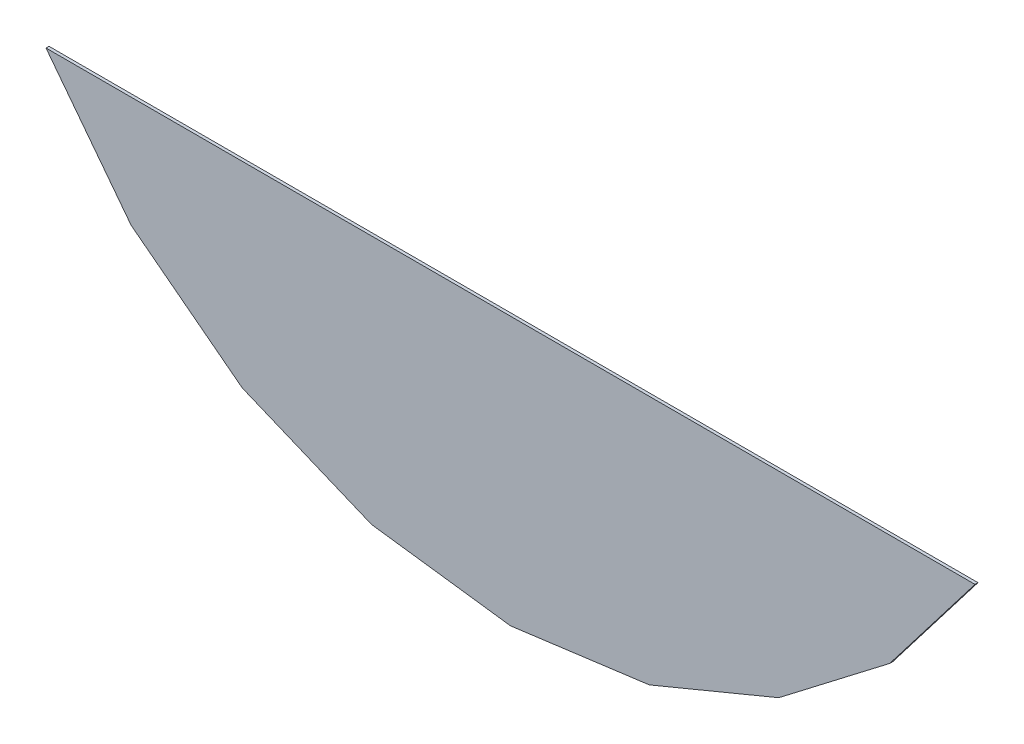
ISO-10303-21;
HEADER;
FILE_DESCRIPTION(('STEP AP214'),'2;1');
FILE_NAME('part.step','',(''),(''),'','','');
FILE_SCHEMA(('AUTOMOTIVE_DESIGN { 1 0 10303 214 1 1 1 1 }'));
ENDSEC;
DATA;
#1=APPLICATION_CONTEXT('core data for automotive mechanical design processes');
#2=APPLICATION_PROTOCOL_DEFINITION('international standard','automotive_design',2000,#1);
#3=PRODUCT_CONTEXT('',#1,'mechanical');
#4=PRODUCT('Part','Part','',(#3));
#5=PRODUCT_RELATED_PRODUCT_CATEGORY('part','',(#4));
#6=PRODUCT_DEFINITION_FORMATION('','',#4);
#7=PRODUCT_DEFINITION_CONTEXT('part definition',#1,'design');
#8=PRODUCT_DEFINITION('design','',#6,#7);
#9=PRODUCT_DEFINITION_SHAPE('','',#8);
#10=(LENGTH_UNIT() NAMED_UNIT(*) SI_UNIT(.MILLI.,.METRE.));
#11=(NAMED_UNIT(*) PLANE_ANGLE_UNIT() SI_UNIT($,.RADIAN.));
#12=(NAMED_UNIT(*) SI_UNIT($,.STERADIAN.) SOLID_ANGLE_UNIT());
#13=UNCERTAINTY_MEASURE_WITH_UNIT(LENGTH_MEASURE(1.E-05),#10,'distance_accuracy_value','');
#14=(GEOMETRIC_REPRESENTATION_CONTEXT(3) GLOBAL_UNCERTAINTY_ASSIGNED_CONTEXT((#13)) GLOBAL_UNIT_ASSIGNED_CONTEXT((#10,
#11,#12)) REPRESENTATION_CONTEXT('',''));
#15=CARTESIAN_POINT('',(0.,0.,0.));
#16=DIRECTION('',(0.,0.,1.));
#17=DIRECTION('',(1.,0.,0.));
#18=AXIS2_PLACEMENT_3D('',#15,#16,#17);
#19=CARTESIAN_POINT('',(-1.5588488,-2.74280376,3.9099998));
#20=DIRECTION('',(0.,0.,1.));
#21=DIRECTION('',(1.,0.,0.));
#22=AXIS2_PLACEMENT_3D('',#19,#20,#21);
#23=PLANE('',#22);
#24=DIRECTION('',(0.923880918501279,0.382680086272116,0.));
#25=VECTOR('',#24,1.);
#26=CARTESIAN_POINT('',(0.465871559999998,-3.58146857999999,3.9099998));
#27=LINE('',#26,#25);
#28=CARTESIAN_POINT('',(0.465871559999994,-3.58146857999999,3.9099998));
#29=VERTEX_POINT('',#28);
#30=CARTESIAN_POINT('',(0.899998200000018,-3.40164928000003,3.9099998));
#31=VERTEX_POINT('',#30);
#32=EDGE_CURVE('E91',#29,#31,#27,.T.);
#33=ORIENTED_EDGE('',*,*,#32,.T.);
#34=DIRECTION('',(0.79335085331093,0.608764670090848,0.));
#35=VECTOR('',#34,1.);
#36=CARTESIAN_POINT('',(0.899998200000011,-3.40164928000002,3.9099998));
#37=LINE('',#36,#35);
#38=CARTESIAN_POINT('',(1.27278891999997,-3.11559447999999,3.9099998));
#39=VERTEX_POINT('',#38);
#40=EDGE_CURVE('E88',#31,#39,#37,.T.);
#41=ORIENTED_EDGE('',*,*,#40,.T.);
#42=DIRECTION('',(0.608764670090813,0.793350853310957,0.));
#43=VECTOR('',#42,1.);
#44=CARTESIAN_POINT('',(1.27278891999998,-3.11559447999999,3.9099998));
#45=LINE('',#44,#43);
#46=CARTESIAN_POINT('',(1.55884372,-2.74280376,3.9099998));
#47=VERTEX_POINT('',#46);
#48=EDGE_CURVE('E20',#39,#47,#45,.T.);
#49=ORIENTED_EDGE('',*,*,#48,.T.);
#50=DIRECTION('',(1.,0.,0.));
#51=VECTOR('',#50,1.);
#52=CARTESIAN_POINT('',(-1.5588488,-2.74280376,3.9099998));
#53=LINE('',#52,#51);
#54=CARTESIAN_POINT('',(-1.55884880000005,-2.74280376000001,3.9099998));
#55=VERTEX_POINT('',#54);
#56=EDGE_CURVE('E94',#55,#47,#53,.T.);
#57=ORIENTED_EDGE('',*,*,#56,.F.);
#58=DIRECTION('',(0.608764670090872,-0.793350853310912,0.));
#59=VECTOR('',#58,1.);
#60=CARTESIAN_POINT('',(-1.55884880000003,-2.74280376000002,3.9099998));
#61=LINE('',#60,#59);
#62=CARTESIAN_POINT('',(-1.27279399999999,-3.11559447999997,3.9099998));
#63=VERTEX_POINT('',#62);
#64=EDGE_CURVE('E84',#55,#63,#61,.T.);
#65=ORIENTED_EDGE('',*,*,#64,.T.);
#66=DIRECTION('',(0.793350853310943,-0.608764670090831,0.));
#67=VECTOR('',#66,1.);
#68=CARTESIAN_POINT('',(-1.27279399999999,-3.11559447999998,3.9099998));
#69=LINE('',#68,#67);
#70=CARTESIAN_POINT('',(-0.900003280000005,-3.40164928000001,3.9099998));
#71=VERTEX_POINT('',#70);
#72=EDGE_CURVE('E105',#63,#71,#69,.T.);
#73=ORIENTED_EDGE('',*,*,#72,.T.);
#74=DIRECTION('',(0.923880918501228,-0.382680086272237,0.));
#75=VECTOR('',#74,1.);
#76=CARTESIAN_POINT('',(-0.900003280000004,-3.40164928000001,3.9099998));
#77=LINE('',#76,#75);
#78=CARTESIAN_POINT('',(-0.465876640000007,-3.58146858000006,3.9099998));
#79=VERTEX_POINT('',#78);
#80=EDGE_CURVE('E106',#71,#79,#77,.T.);
#81=ORIENTED_EDGE('',*,*,#80,.T.);
#82=DIRECTION('',(0.991444891344724,-0.130525964568163,0.));
#83=VECTOR('',#82,1.);
#84=CARTESIAN_POINT('',(-0.465876640000006,-3.58146858000004,3.9099998));
#85=LINE('',#84,#83);
#86=CARTESIAN_POINT('',(-2.54000000878586E-06,-3.64280195999994,3.9099998));
#87=VERTEX_POINT('',#86);
#88=EDGE_CURVE('E110',#79,#87,#85,.T.);
#89=ORIENTED_EDGE('',*,*,#88,.T.);
#90=DIRECTION('',(0.99144489134471,0.130525964568269,0.));
#91=VECTOR('',#90,1.);
#92=CARTESIAN_POINT('',(-2.54000000307793E-06,-3.64280195999996,3.9099998));
#93=LINE('',#92,#91);
#94=EDGE_CURVE('E112',#87,#29,#93,.T.);
#95=ORIENTED_EDGE('',*,*,#94,.T.);
#96=EDGE_LOOP('',(#33,#41,#49,#57,#65,#73,#81,#89,#95));
#97=FACE_BOUND('',#96,.T.);
#98=ADVANCED_FACE('F17',(#97),#23,.T.);
#99=CARTESIAN_POINT('',(-1.5588488,-2.74280376,3.89999982));
#100=DIRECTION('',(0.,1.,0.));
#101=DIRECTION('',(0.,0.,1.));
#102=AXIS2_PLACEMENT_3D('',#99,#100,#101);
#103=PLANE('',#102);
#104=DIRECTION('',(0.,0.,1.));
#105=VECTOR('',#104,1.);
#106=CARTESIAN_POINT('',(-1.55884880000006,-2.74280376000005,3.89999982));
#107=LINE('',#106,#105);
#108=CARTESIAN_POINT('',(-1.55884880000004,-2.74280376000001,3.89999982));
#109=VERTEX_POINT('',#108);
#110=EDGE_CURVE('E116',#55,#109,#107,.F.);
#111=ORIENTED_EDGE('',*,*,#110,.F.);
#112=ORIENTED_EDGE('',*,*,#56,.T.);
#113=DIRECTION('',(0.,0.,1.));
#114=VECTOR('',#113,1.);
#115=CARTESIAN_POINT('',(1.55884372,-2.74280376,3.89999982));
#116=LINE('',#115,#114);
#117=CARTESIAN_POINT('',(1.55884372,-2.74280376,3.89999982));
#118=VERTEX_POINT('',#117);
#119=EDGE_CURVE('E99',#118,#47,#116,.T.);
#120=ORIENTED_EDGE('',*,*,#119,.F.);
#121=DIRECTION('',(1.,0.,0.));
#122=VECTOR('',#121,1.);
#123=CARTESIAN_POINT('',(-1.5588488,-2.74280376,3.89999982));
#124=LINE('',#123,#122);
#125=EDGE_CURVE('E130',#118,#109,#124,.F.);
#126=ORIENTED_EDGE('',*,*,#125,.T.);
#127=EDGE_LOOP('',(#111,#112,#120,#126));
#128=FACE_BOUND('',#127,.T.);
#129=ADVANCED_FACE('F181',(#128),#103,.T.);
#130=CARTESIAN_POINT('',(-1.272794,-3.11559448,3.89999982));
#131=DIRECTION('',(-0.793350853310883,-0.60876467009091,0.));
#132=DIRECTION('',(0.60876467009091,-0.793350853310883,0.));
#133=AXIS2_PLACEMENT_3D('',#130,#131,#132);
#134=PLANE('',#133);
#135=DIRECTION('',(0.,0.,1.));
#136=VECTOR('',#135,1.);
#137=CARTESIAN_POINT('',(-1.27279399999996,-3.11559447999994,3.89999982));
#138=LINE('',#137,#136);
#139=CARTESIAN_POINT('',(-1.27279399999999,-3.11559447999997,3.89999982));
#140=VERTEX_POINT('',#139);
#141=EDGE_CURVE('E118',#63,#140,#138,.F.);
#142=ORIENTED_EDGE('',*,*,#141,.F.);
#143=ORIENTED_EDGE('',*,*,#64,.F.);
#144=ORIENTED_EDGE('',*,*,#110,.T.);
#145=DIRECTION('',(0.608764670090872,-0.793350853310912,0.));
#146=VECTOR('',#145,1.);
#147=CARTESIAN_POINT('',(-1.55884880000003,-2.74280376000002,3.89999982));
#148=LINE('',#147,#146);
#149=EDGE_CURVE('E133',#109,#140,#148,.T.);
#150=ORIENTED_EDGE('',*,*,#149,.T.);
#151=EDGE_LOOP('',(#142,#143,#144,#150));
#152=FACE_BOUND('',#151,.T.);
#153=ADVANCED_FACE('F178',(#152),#134,.T.);
#154=CARTESIAN_POINT('',(-0.90000328,-3.40164928,3.89999982));
#155=DIRECTION('',(-0.60876467009091,-0.793350853310883,0.));
#156=DIRECTION('',(0.793350853310883,-0.60876467009091,0.));
#157=AXIS2_PLACEMENT_3D('',#154,#155,#156);
#158=PLANE('',#157);
#159=DIRECTION('',(0.,0.,1.));
#160=VECTOR('',#159,1.);
#161=CARTESIAN_POINT('',(-0.900003280000013,-3.40164928000003,3.89999982));
#162=LINE('',#161,#160);
#163=CARTESIAN_POINT('',(-0.900003280000003,-3.40164928000001,3.89999982));
#164=VERTEX_POINT('',#163);
#165=EDGE_CURVE('E120',#71,#164,#162,.F.);
#166=ORIENTED_EDGE('',*,*,#165,.F.);
#167=ORIENTED_EDGE('',*,*,#72,.F.);
#168=ORIENTED_EDGE('',*,*,#141,.T.);
#169=DIRECTION('',(0.793350853310943,-0.608764670090831,0.));
#170=VECTOR('',#169,1.);
#171=CARTESIAN_POINT('',(-1.27279399999999,-3.11559447999998,3.89999982));
#172=LINE('',#171,#170);
#173=EDGE_CURVE('E136',#140,#164,#172,.T.);
#174=ORIENTED_EDGE('',*,*,#173,.T.);
#175=EDGE_LOOP('',(#166,#167,#168,#174));
#176=FACE_BOUND('',#175,.T.);
#177=ADVANCED_FACE('F175',(#176),#158,.T.);
#178=CARTESIAN_POINT('',(-0.46587664,-3.58146858,3.89999982));
#179=DIRECTION('',(-0.382680086272115,-0.923880918501279,0.));
#180=DIRECTION('',(0.923880918501279,-0.382680086272115,0.));
#181=AXIS2_PLACEMENT_3D('',#178,#179,#180);
#182=PLANE('',#181);
#183=DIRECTION('',(0.,0.,1.));
#184=VECTOR('',#183,1.);
#185=CARTESIAN_POINT('',(-0.465876640000023,-3.58146858000017,3.89999982));
#186=LINE('',#185,#184);
#187=CARTESIAN_POINT('',(-0.465876640000003,-3.58146858000005,3.89999982));
#188=VERTEX_POINT('',#187);
#189=EDGE_CURVE('E122',#79,#188,#186,.F.);
#190=ORIENTED_EDGE('',*,*,#189,.F.);
#191=ORIENTED_EDGE('',*,*,#80,.F.);
#192=ORIENTED_EDGE('',*,*,#165,.T.);
#193=DIRECTION('',(0.923880918501228,-0.382680086272237,0.));
#194=VECTOR('',#193,1.);
#195=CARTESIAN_POINT('',(-0.900003280000004,-3.40164928000001,3.89999982));
#196=LINE('',#195,#194);
#197=EDGE_CURVE('E139',#164,#188,#196,.T.);
#198=ORIENTED_EDGE('',*,*,#197,.T.);
#199=EDGE_LOOP('',(#190,#191,#192,#198));
#200=FACE_BOUND('',#199,.T.);
#201=ADVANCED_FACE('F170',(#200),#182,.T.);
#202=CARTESIAN_POINT('',(-2.539999996998E-06,-3.64280196,3.89999982));
#203=DIRECTION('',(-0.130525964567967,-0.991444891344749,0.));
#204=DIRECTION('',(0.991444891344749,-0.130525964567967,0.));
#205=AXIS2_PLACEMENT_3D('',#202,#203,#204);
#206=PLANE('',#205);
#207=DIRECTION('',(0.,0.,1.));
#208=VECTOR('',#207,1.);
#209=CARTESIAN_POINT('',(-2.54000002047937E-06,-3.64280195999983,3.89999982));
#210=LINE('',#209,#208);
#211=CARTESIAN_POINT('',(-2.54000000975995E-06,-3.64280195999995,3.89999982));
#212=VERTEX_POINT('',#211);
#213=EDGE_CURVE('E124',#87,#212,#210,.F.);
#214=ORIENTED_EDGE('',*,*,#213,.F.);
#215=ORIENTED_EDGE('',*,*,#88,.F.);
#216=ORIENTED_EDGE('',*,*,#189,.T.);
#217=DIRECTION('',(0.991444891344724,-0.130525964568163,0.));
#218=VECTOR('',#217,1.);
#219=CARTESIAN_POINT('',(-0.465876640000006,-3.58146858000004,3.89999982));
#220=LINE('',#219,#218);
#221=EDGE_CURVE('E142',#188,#212,#220,.T.);
#222=ORIENTED_EDGE('',*,*,#221,.T.);
#223=EDGE_LOOP('',(#214,#215,#216,#222));
#224=FACE_BOUND('',#223,.T.);
#225=ADVANCED_FACE('F165',(#224),#206,.T.);
#226=CARTESIAN_POINT('',(0.46587156,-3.58146858,3.89999982));
#227=DIRECTION('',(0.130525964567967,-0.991444891344749,0.));
#228=DIRECTION('',(0.991444891344749,0.130525964567967,0.));
#229=AXIS2_PLACEMENT_3D('',#226,#227,#228);
#230=PLANE('',#229);
#231=DIRECTION('',(0.,0.,1.));
#232=VECTOR('',#231,1.);
#233=CARTESIAN_POINT('',(0.465871559999989,-3.58146857999997,3.89999982));
#234=LINE('',#233,#232);
#235=CARTESIAN_POINT('',(0.465871559999995,-3.58146857999999,3.89999982));
#236=VERTEX_POINT('',#235);
#237=EDGE_CURVE('E126',#29,#236,#234,.F.);
#238=ORIENTED_EDGE('',*,*,#237,.F.);
#239=ORIENTED_EDGE('',*,*,#94,.F.);
#240=ORIENTED_EDGE('',*,*,#213,.T.);
#241=DIRECTION('',(0.99144489134471,0.130525964568269,0.));
#242=VECTOR('',#241,1.);
#243=CARTESIAN_POINT('',(-2.54000000286109E-06,-3.64280195999996,3.89999982));
#244=LINE('',#243,#242);
#245=EDGE_CURVE('E145',#212,#236,#244,.T.);
#246=ORIENTED_EDGE('',*,*,#245,.T.);
#247=EDGE_LOOP('',(#238,#239,#240,#246));
#248=FACE_BOUND('',#247,.T.);
#249=ADVANCED_FACE('F160',(#248),#230,.T.);
#250=CARTESIAN_POINT('',(0.8999982,-3.40164928,3.89999982));
#251=DIRECTION('',(0.382680086272115,-0.923880918501279,0.));
#252=DIRECTION('',(0.923880918501279,0.382680086272115,0.));
#253=AXIS2_PLACEMENT_3D('',#250,#251,#252);
#254=PLANE('',#253);
#255=DIRECTION('',(0.,0.,1.));
#256=VECTOR('',#255,1.);
#257=CARTESIAN_POINT('',(0.899998200000045,-3.40164928000006,3.89999982));
#258=LINE('',#257,#256);
#259=CARTESIAN_POINT('',(0.899998200000015,-3.40164928000002,3.89999982));
#260=VERTEX_POINT('',#259);
#261=EDGE_CURVE('E100',#31,#260,#258,.F.);
#262=ORIENTED_EDGE('',*,*,#261,.F.);
#263=ORIENTED_EDGE('',*,*,#32,.F.);
#264=ORIENTED_EDGE('',*,*,#237,.T.);
#265=DIRECTION('',(0.923880918501279,0.382680086272115,0.));
#266=VECTOR('',#265,1.);
#267=CARTESIAN_POINT('',(0.465871559999997,-3.58146857999999,3.89999982));
#268=LINE('',#267,#266);
#269=EDGE_CURVE('E148',#236,#260,#268,.T.);
#270=ORIENTED_EDGE('',*,*,#269,.T.);
#271=EDGE_LOOP('',(#262,#263,#264,#270));
#272=FACE_BOUND('',#271,.T.);
#273=ADVANCED_FACE('F153',(#272),#254,.T.);
#274=CARTESIAN_POINT('',(1.27278892,-3.11559448,3.89999982));
#275=DIRECTION('',(0.60876467009091,-0.793350853310883,0.));
#276=DIRECTION('',(0.793350853310883,0.60876467009091,0.));
#277=AXIS2_PLACEMENT_3D('',#274,#275,#276);
#278=PLANE('',#277);
#279=DIRECTION('',(0.,0.,1.));
#280=VECTOR('',#279,1.);
#281=CARTESIAN_POINT('',(1.27278891999993,-3.11559447999996,3.89999982));
#282=LINE('',#281,#280);
#283=CARTESIAN_POINT('',(1.27278891999997,-3.11559447999999,3.89999982));
#284=VERTEX_POINT('',#283);
#285=EDGE_CURVE('E34',#39,#284,#282,.F.);
#286=ORIENTED_EDGE('',*,*,#285,.F.);
#287=ORIENTED_EDGE('',*,*,#40,.F.);
#288=ORIENTED_EDGE('',*,*,#261,.T.);
#289=DIRECTION('',(0.793350853310929,0.608764670090849,0.));
#290=VECTOR('',#289,1.);
#291=CARTESIAN_POINT('',(0.899998200000012,-3.40164928000002,3.89999982));
#292=LINE('',#291,#290);
#293=EDGE_CURVE('E26',#260,#284,#292,.T.);
#294=ORIENTED_EDGE('',*,*,#293,.T.);
#295=EDGE_LOOP('',(#286,#287,#288,#294));
#296=FACE_BOUND('',#295,.T.);
#297=ADVANCED_FACE('F97',(#296),#278,.T.);
#298=CARTESIAN_POINT('',(1.55884372,-2.74280376,3.89999982));
#299=DIRECTION('',(0.793350853310883,-0.60876467009091,0.));
#300=DIRECTION('',(0.60876467009091,0.793350853310883,0.));
#301=AXIS2_PLACEMENT_3D('',#298,#299,#300);
#302=PLANE('',#301);
#303=ORIENTED_EDGE('',*,*,#119,.T.);
#304=ORIENTED_EDGE('',*,*,#48,.F.);
#305=ORIENTED_EDGE('',*,*,#285,.T.);
#306=DIRECTION('',(0.608764670090813,0.793350853310957,0.));
#307=VECTOR('',#306,1.);
#308=CARTESIAN_POINT('',(1.27278891999998,-3.11559447999999,3.89999982));
#309=LINE('',#308,#307);
#310=EDGE_CURVE('E11',#284,#118,#309,.T.);
#311=ORIENTED_EDGE('',*,*,#310,.T.);
#312=EDGE_LOOP('',(#303,#304,#305,#311));
#313=FACE_BOUND('',#312,.T.);
#314=ADVANCED_FACE('F103',(#313),#302,.T.);
#315=CARTESIAN_POINT('',(-1.5588488,-2.74280376,3.89999982));
#316=DIRECTION('',(0.,0.,1.));
#317=DIRECTION('',(1.,0.,0.));
#318=AXIS2_PLACEMENT_3D('',#315,#316,#317);
#319=PLANE('',#318);
#320=ORIENTED_EDGE('',*,*,#293,.F.);
#321=ORIENTED_EDGE('',*,*,#269,.F.);
#322=ORIENTED_EDGE('',*,*,#245,.F.);
#323=ORIENTED_EDGE('',*,*,#221,.F.);
#324=ORIENTED_EDGE('',*,*,#197,.F.);
#325=ORIENTED_EDGE('',*,*,#173,.F.);
#326=ORIENTED_EDGE('',*,*,#149,.F.);
#327=ORIENTED_EDGE('',*,*,#125,.F.);
#328=ORIENTED_EDGE('',*,*,#310,.F.);
#329=EDGE_LOOP('',(#320,#321,#322,#323,#324,#325,#326,#327,#328));
#330=FACE_BOUND('',#329,.T.);
#331=ADVANCED_FACE('F157',(#330),#319,.F.);
#332=CLOSED_SHELL('',(#98,#129,#153,#177,#201,#225,#249,#273,#297,#314,#331));
#333=MANIFOLD_SOLID_BREP('B1',#332);
#334=ADVANCED_BREP_SHAPE_REPRESENTATION('',(#18,#333),#14);
#335=SHAPE_DEFINITION_REPRESENTATION(#9,#334);
ENDSEC;
END-ISO-10303-21;
